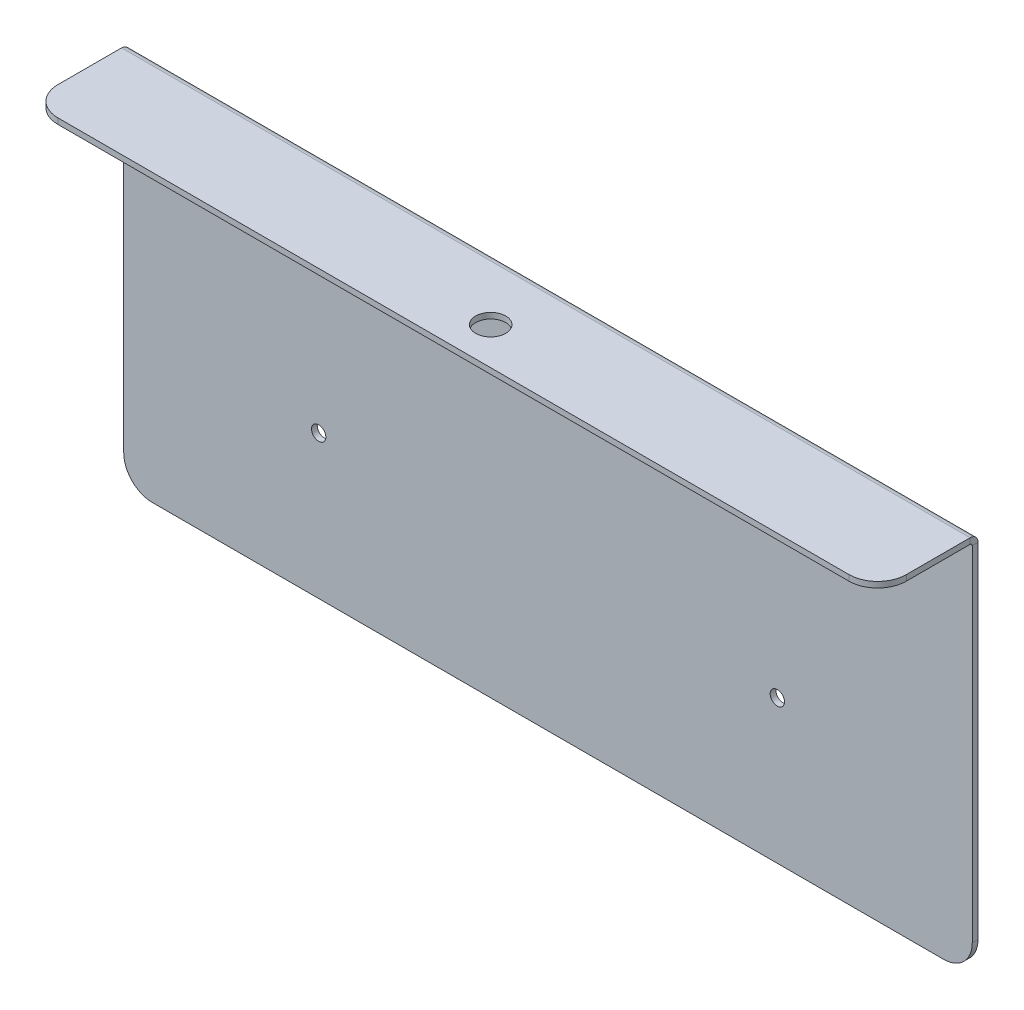
ISO-10303-21;
HEADER;
FILE_DESCRIPTION(('STEP AP214'),'2;1');
FILE_NAME('part.step','',(''),(''),'','','');
FILE_SCHEMA(('AUTOMOTIVE_DESIGN { 1 0 10303 214 1 1 1 1 }'));
ENDSEC;
DATA;
#1=APPLICATION_CONTEXT('core data for automotive mechanical design processes');
#2=APPLICATION_PROTOCOL_DEFINITION('international standard','automotive_design',2000,#1);
#3=PRODUCT_CONTEXT('',#1,'mechanical');
#4=PRODUCT('Part','Part','',(#3));
#5=PRODUCT_RELATED_PRODUCT_CATEGORY('part','',(#4));
#6=PRODUCT_DEFINITION_FORMATION('','',#4);
#7=PRODUCT_DEFINITION_CONTEXT('part definition',#1,'design');
#8=PRODUCT_DEFINITION('design','',#6,#7);
#9=PRODUCT_DEFINITION_SHAPE('','',#8);
#10=(LENGTH_UNIT() NAMED_UNIT(*) SI_UNIT(.MILLI.,.METRE.));
#11=(NAMED_UNIT(*) PLANE_ANGLE_UNIT() SI_UNIT($,.RADIAN.));
#12=(NAMED_UNIT(*) SI_UNIT($,.STERADIAN.) SOLID_ANGLE_UNIT());
#13=UNCERTAINTY_MEASURE_WITH_UNIT(LENGTH_MEASURE(1.E-05),#10,'distance_accuracy_value','');
#14=(GEOMETRIC_REPRESENTATION_CONTEXT(3) GLOBAL_UNCERTAINTY_ASSIGNED_CONTEXT((#13)) GLOBAL_UNIT_ASSIGNED_CONTEXT((#10,
#11,#12)) REPRESENTATION_CONTEXT('',''));
#15=CARTESIAN_POINT('',(0.,0.,0.));
#16=DIRECTION('',(0.,0.,1.));
#17=DIRECTION('',(1.,0.,0.));
#18=AXIS2_PLACEMENT_3D('',#15,#16,#17);
#19=CARTESIAN_POINT('',(-138.,67.7366000000001,23.));
#20=DIRECTION('',(0.,-1.,0.));
#21=DIRECTION('',(0.,0.,-1.));
#22=AXIS2_PLACEMENT_3D('',#19,#20,#21);
#23=CYLINDRICAL_SURFACE('',#22,10.);
#24=DIRECTION('',(0.,1.,0.));
#25=VECTOR('',#24,1.);
#26=CARTESIAN_POINT('',(-148.,67.7366000000001,23.));
#27=LINE('',#26,#25);
#28=CARTESIAN_POINT('',(-148.,65.7366000000001,23.));
#29=VERTEX_POINT('',#28);
#30=CARTESIAN_POINT('',(-148.,67.7366000000001,23.));
#31=VERTEX_POINT('',#30);
#32=EDGE_CURVE('E11',#29,#31,#27,.T.);
#33=ORIENTED_EDGE('',*,*,#32,.F.);
#34=CARTESIAN_POINT('',(-138.,65.7366000000001,23.));
#35=DIRECTION('',(0.,-1.,0.));
#36=DIRECTION('',(0.,0.,-1.));
#37=AXIS2_PLACEMENT_3D('',#34,#35,#36);
#38=CIRCLE('',#37,10.);
#39=CARTESIAN_POINT('',(-138.,65.7366000000001,33.));
#40=VERTEX_POINT('',#39);
#41=EDGE_CURVE('E101',#29,#40,#38,.F.);
#42=ORIENTED_EDGE('',*,*,#41,.T.);
#43=DIRECTION('',(0.,1.,0.));
#44=VECTOR('',#43,1.);
#45=CARTESIAN_POINT('',(-138.,67.7366000000001,33.));
#46=LINE('',#45,#44);
#47=CARTESIAN_POINT('',(-138.,67.7366000000001,33.));
#48=VERTEX_POINT('',#47);
#49=EDGE_CURVE('E51',#40,#48,#46,.T.);
#50=ORIENTED_EDGE('',*,*,#49,.T.);
#51=CARTESIAN_POINT('',(-138.,67.7366000000001,23.));
#52=DIRECTION('',(0.,-1.,0.));
#53=DIRECTION('',(0.,0.,-1.));
#54=AXIS2_PLACEMENT_3D('',#51,#52,#53);
#55=CIRCLE('',#54,10.);
#56=EDGE_CURVE('E104',#31,#48,#55,.F.);
#57=ORIENTED_EDGE('',*,*,#56,.F.);
#58=EDGE_LOOP('',(#33,#42,#50,#57));
#59=FACE_BOUND('',#58,.T.);
#60=ADVANCED_FACE('F41',(#59),#23,.T.);
#61=CARTESIAN_POINT('',(0.,67.7366000000001,33.));
#62=DIRECTION('',(0.,0.,-1.));
#63=DIRECTION('',(1.,0.,0.));
#64=AXIS2_PLACEMENT_3D('',#61,#62,#63);
#65=PLANE('',#64);
#66=ORIENTED_EDGE('',*,*,#49,.F.);
#67=DIRECTION('',(1.,0.,0.));
#68=VECTOR('',#67,1.);
#69=CARTESIAN_POINT('',(0.,65.7366000000001,33.));
#70=LINE('',#69,#68);
#71=CARTESIAN_POINT('',(138.,65.7366000000001,33.));
#72=VERTEX_POINT('',#71);
#73=EDGE_CURVE('E117',#40,#72,#70,.T.);
#74=ORIENTED_EDGE('',*,*,#73,.T.);
#75=DIRECTION('',(0.,1.,0.));
#76=VECTOR('',#75,1.);
#77=CARTESIAN_POINT('',(138.,67.7366000000001,33.));
#78=LINE('',#77,#76);
#79=CARTESIAN_POINT('',(138.,67.7366000000001,33.));
#80=VERTEX_POINT('',#79);
#81=EDGE_CURVE('E158',#72,#80,#78,.T.);
#82=ORIENTED_EDGE('',*,*,#81,.T.);
#83=DIRECTION('',(1.,0.,0.));
#84=VECTOR('',#83,1.);
#85=CARTESIAN_POINT('',(0.,67.7366000000001,33.));
#86=LINE('',#85,#84);
#87=EDGE_CURVE('E170',#48,#80,#86,.T.);
#88=ORIENTED_EDGE('',*,*,#87,.F.);
#89=EDGE_LOOP('',(#66,#74,#82,#88));
#90=FACE_BOUND('',#89,.T.);
#91=ADVANCED_FACE('F175',(#90),#65,.F.);
#92=CARTESIAN_POINT('',(138.,67.7366000000001,23.));
#93=DIRECTION('',(0.,-1.,0.));
#94=DIRECTION('',(0.,0.,-1.));
#95=AXIS2_PLACEMENT_3D('',#92,#93,#94);
#96=CYLINDRICAL_SURFACE('',#95,10.);
#97=ORIENTED_EDGE('',*,*,#81,.F.);
#98=CARTESIAN_POINT('',(138.,65.7366000000001,23.));
#99=DIRECTION('',(0.,-1.,0.));
#100=DIRECTION('',(0.,0.,-1.));
#101=AXIS2_PLACEMENT_3D('',#98,#99,#100);
#102=CIRCLE('',#101,10.);
#103=CARTESIAN_POINT('',(148.,65.7366000000001,23.));
#104=VERTEX_POINT('',#103);
#105=EDGE_CURVE('E220',#72,#104,#102,.F.);
#106=ORIENTED_EDGE('',*,*,#105,.T.);
#107=DIRECTION('',(0.,1.,0.));
#108=VECTOR('',#107,1.);
#109=CARTESIAN_POINT('',(148.,67.7366000000001,23.));
#110=LINE('',#109,#108);
#111=CARTESIAN_POINT('',(148.,67.7366000000001,23.));
#112=VERTEX_POINT('',#111);
#113=EDGE_CURVE('E155',#104,#112,#110,.T.);
#114=ORIENTED_EDGE('',*,*,#113,.T.);
#115=CARTESIAN_POINT('',(138.,67.7366000000001,23.));
#116=DIRECTION('',(0.,-1.,0.));
#117=DIRECTION('',(0.,0.,-1.));
#118=AXIS2_PLACEMENT_3D('',#115,#116,#117);
#119=CIRCLE('',#118,10.);
#120=EDGE_CURVE('E176',#80,#112,#119,.F.);
#121=ORIENTED_EDGE('',*,*,#120,.F.);
#122=EDGE_LOOP('',(#97,#106,#114,#121));
#123=FACE_BOUND('',#122,.T.);
#124=ADVANCED_FACE('F223',(#123),#96,.T.);
#125=CARTESIAN_POINT('',(148.,67.7366,-2.25663255406884E-13));
#126=DIRECTION('',(-1.,0.,0.));
#127=DIRECTION('',(0.,0.,-1.));
#128=AXIS2_PLACEMENT_3D('',#125,#126,#127);
#129=PLANE('',#128);
#130=ORIENTED_EDGE('',*,*,#113,.F.);
#131=DIRECTION('',(0.,0.,-1.));
#132=VECTOR('',#131,1.);
#133=CARTESIAN_POINT('',(148.,65.7366,-2.18934631015216E-13));
#134=LINE('',#133,#132);
#135=CARTESIAN_POINT('',(148.,65.7366,0.736600000000008));
#136=VERTEX_POINT('',#135);
#137=EDGE_CURVE('E200',#104,#136,#134,.T.);
#138=ORIENTED_EDGE('',*,*,#137,.T.);
#139=DIRECTION('',(0.,1.,0.));
#140=VECTOR('',#139,1.);
#141=CARTESIAN_POINT('',(148.,67.7366,0.736600000000001));
#142=LINE('',#141,#140);
#143=CARTESIAN_POINT('',(148.,67.7366,0.736600000000001));
#144=VERTEX_POINT('',#143);
#145=EDGE_CURVE('E153',#136,#144,#142,.T.);
#146=ORIENTED_EDGE('',*,*,#145,.T.);
#147=DIRECTION('',(0.,0.,-1.));
#148=VECTOR('',#147,1.);
#149=CARTESIAN_POINT('',(148.,67.7366,-2.25663255406884E-13));
#150=LINE('',#149,#148);
#151=EDGE_CURVE('E178',#112,#144,#150,.T.);
#152=ORIENTED_EDGE('',*,*,#151,.F.);
#153=EDGE_LOOP('',(#130,#138,#146,#152));
#154=FACE_BOUND('',#153,.T.);
#155=ADVANCED_FACE('F226',(#154),#129,.F.);
#156=CARTESIAN_POINT('',(148.,65.,0.73660000000001));
#157=DIRECTION('',(1.,0.,0.));
#158=DIRECTION('',(0.,0.,-1.));
#159=AXIS2_PLACEMENT_3D('',#156,#157,#158);
#160=PLANE('',#159);
#161=ORIENTED_EDGE('',*,*,#145,.F.);
#162=CARTESIAN_POINT('',(148.,65.,0.73660000000001));
#163=DIRECTION('',(-1.,0.,0.));
#164=DIRECTION('',(0.,0.,1.));
#165=AXIS2_PLACEMENT_3D('',#162,#163,#164);
#166=CIRCLE('',#165,0.736600000000004);
#167=CARTESIAN_POINT('',(148.,65.,0.));
#168=VERTEX_POINT('',#167);
#169=EDGE_CURVE('E203',#168,#136,#166,.F.);
#170=ORIENTED_EDGE('',*,*,#169,.F.);
#171=DIRECTION('',(0.,0.,-1.));
#172=VECTOR('',#171,1.);
#173=CARTESIAN_POINT('',(148.,65.,-2.));
#174=LINE('',#173,#172);
#175=CARTESIAN_POINT('',(148.,65.,-2.));
#176=VERTEX_POINT('',#175);
#177=EDGE_CURVE('E150',#168,#176,#174,.T.);
#178=ORIENTED_EDGE('',*,*,#177,.T.);
#179=CARTESIAN_POINT('',(148.,65.,0.73660000000001));
#180=DIRECTION('',(-1.,0.,0.));
#181=DIRECTION('',(0.,0.,1.));
#182=AXIS2_PLACEMENT_3D('',#179,#180,#181);
#183=CIRCLE('',#182,2.7366);
#184=EDGE_CURVE('E189',#176,#144,#183,.F.);
#185=ORIENTED_EDGE('',*,*,#184,.T.);
#186=EDGE_LOOP('',(#161,#170,#178,#185));
#187=FACE_BOUND('',#186,.T.);
#188=ADVANCED_FACE('F233',(#187),#160,.T.);
#189=CARTESIAN_POINT('',(148.,-65.,-2.));
#190=DIRECTION('',(-1.,0.,0.));
#191=DIRECTION('',(0.,1.,0.));
#192=AXIS2_PLACEMENT_3D('',#189,#190,#191);
#193=PLANE('',#192);
#194=ORIENTED_EDGE('',*,*,#177,.F.);
#195=DIRECTION('',(0.,1.,0.));
#196=VECTOR('',#195,1.);
#197=CARTESIAN_POINT('',(148.,0.,0.));
#198=LINE('',#197,#196);
#199=CARTESIAN_POINT('',(148.,-55.,0.));
#200=VERTEX_POINT('',#199);
#201=EDGE_CURVE('E195',#200,#168,#198,.T.);
#202=ORIENTED_EDGE('',*,*,#201,.F.);
#203=DIRECTION('',(0.,0.,-1.));
#204=VECTOR('',#203,1.);
#205=CARTESIAN_POINT('',(148.,-55.,-2.));
#206=LINE('',#205,#204);
#207=CARTESIAN_POINT('',(148.,-55.,-2.));
#208=VERTEX_POINT('',#207);
#209=EDGE_CURVE('E147',#200,#208,#206,.T.);
#210=ORIENTED_EDGE('',*,*,#209,.T.);
#211=DIRECTION('',(0.,1.,0.));
#212=VECTOR('',#211,1.);
#213=CARTESIAN_POINT('',(148.,-65.,-2.));
#214=LINE('',#213,#212);
#215=EDGE_CURVE('E283',#208,#176,#214,.T.);
#216=ORIENTED_EDGE('',*,*,#215,.T.);
#217=EDGE_LOOP('',(#194,#202,#210,#216));
#218=FACE_BOUND('',#217,.T.);
#219=ADVANCED_FACE('F340',(#218),#193,.F.);
#220=CARTESIAN_POINT('',(138.,-55.,-2.));
#221=DIRECTION('',(0.,0.,-1.));
#222=DIRECTION('',(-1.,0.,0.));
#223=AXIS2_PLACEMENT_3D('',#220,#221,#222);
#224=CYLINDRICAL_SURFACE('',#223,10.);
#225=ORIENTED_EDGE('',*,*,#209,.F.);
#226=CARTESIAN_POINT('',(138.,-55.,0.));
#227=DIRECTION('',(0.,0.,-1.));
#228=DIRECTION('',(-1.,0.,0.));
#229=AXIS2_PLACEMENT_3D('',#226,#227,#228);
#230=CIRCLE('',#229,10.);
#231=CARTESIAN_POINT('',(138.,-65.,0.));
#232=VERTEX_POINT('',#231);
#233=EDGE_CURVE('E124',#200,#232,#230,.T.);
#234=ORIENTED_EDGE('',*,*,#233,.T.);
#235=DIRECTION('',(0.,0.,-1.));
#236=VECTOR('',#235,1.);
#237=CARTESIAN_POINT('',(138.,-65.,-2.));
#238=LINE('',#237,#236);
#239=CARTESIAN_POINT('',(138.,-65.,-2.));
#240=VERTEX_POINT('',#239);
#241=EDGE_CURVE('E144',#232,#240,#238,.T.);
#242=ORIENTED_EDGE('',*,*,#241,.T.);
#243=CARTESIAN_POINT('',(138.,-55.,-2.));
#244=DIRECTION('',(0.,0.,-1.));
#245=DIRECTION('',(-1.,0.,0.));
#246=AXIS2_PLACEMENT_3D('',#243,#244,#245);
#247=CIRCLE('',#246,10.);
#248=EDGE_CURVE('E272',#208,#240,#247,.T.);
#249=ORIENTED_EDGE('',*,*,#248,.F.);
#250=EDGE_LOOP('',(#225,#234,#242,#249));
#251=FACE_BOUND('',#250,.T.);
#252=ADVANCED_FACE('F338',(#251),#224,.T.);
#253=CARTESIAN_POINT('',(-148.,-65.,-2.));
#254=DIRECTION('',(0.,1.,0.));
#255=DIRECTION('',(1.,0.,0.));
#256=AXIS2_PLACEMENT_3D('',#253,#254,#255);
#257=PLANE('',#256);
#258=ORIENTED_EDGE('',*,*,#241,.F.);
#259=DIRECTION('',(-1.,0.,0.));
#260=VECTOR('',#259,1.);
#261=CARTESIAN_POINT('',(0.,-65.,0.));
#262=LINE('',#261,#260);
#263=CARTESIAN_POINT('',(-138.,-65.,0.));
#264=VERTEX_POINT('',#263);
#265=EDGE_CURVE('E134',#264,#232,#262,.F.);
#266=ORIENTED_EDGE('',*,*,#265,.F.);
#267=DIRECTION('',(0.,0.,-1.));
#268=VECTOR('',#267,1.);
#269=CARTESIAN_POINT('',(-138.,-65.,-2.));
#270=LINE('',#269,#268);
#271=CARTESIAN_POINT('',(-138.,-65.,-2.));
#272=VERTEX_POINT('',#271);
#273=EDGE_CURVE('E141',#264,#272,#270,.T.);
#274=ORIENTED_EDGE('',*,*,#273,.T.);
#275=DIRECTION('',(1.,0.,0.));
#276=VECTOR('',#275,1.);
#277=CARTESIAN_POINT('',(-148.,-65.,-2.));
#278=LINE('',#277,#276);
#279=EDGE_CURVE('E259',#272,#240,#278,.T.);
#280=ORIENTED_EDGE('',*,*,#279,.T.);
#281=EDGE_LOOP('',(#258,#266,#274,#280));
#282=FACE_BOUND('',#281,.T.);
#283=ADVANCED_FACE('F258',(#282),#257,.F.);
#284=CARTESIAN_POINT('',(-138.,-55.,-2.));
#285=DIRECTION('',(0.,0.,-1.));
#286=DIRECTION('',(-1.,0.,0.));
#287=AXIS2_PLACEMENT_3D('',#284,#285,#286);
#288=CYLINDRICAL_SURFACE('',#287,10.);
#289=ORIENTED_EDGE('',*,*,#273,.F.);
#290=CARTESIAN_POINT('',(-138.,-55.,0.));
#291=DIRECTION('',(0.,0.,-1.));
#292=DIRECTION('',(-1.,0.,0.));
#293=AXIS2_PLACEMENT_3D('',#290,#291,#292);
#294=CIRCLE('',#293,10.);
#295=CARTESIAN_POINT('',(-148.,-55.,0.));
#296=VERTEX_POINT('',#295);
#297=EDGE_CURVE('E206',#264,#296,#294,.T.);
#298=ORIENTED_EDGE('',*,*,#297,.T.);
#299=DIRECTION('',(0.,0.,-1.));
#300=VECTOR('',#299,1.);
#301=CARTESIAN_POINT('',(-148.,-55.,-2.));
#302=LINE('',#301,#300);
#303=CARTESIAN_POINT('',(-148.,-55.,-2.));
#304=VERTEX_POINT('',#303);
#305=EDGE_CURVE('E138',#296,#304,#302,.T.);
#306=ORIENTED_EDGE('',*,*,#305,.T.);
#307=CARTESIAN_POINT('',(-138.,-55.,-2.));
#308=DIRECTION('',(0.,0.,-1.));
#309=DIRECTION('',(-1.,0.,0.));
#310=AXIS2_PLACEMENT_3D('',#307,#308,#309);
#311=CIRCLE('',#310,10.);
#312=EDGE_CURVE('E268',#272,#304,#311,.T.);
#313=ORIENTED_EDGE('',*,*,#312,.F.);
#314=EDGE_LOOP('',(#289,#298,#306,#313));
#315=FACE_BOUND('',#314,.T.);
#316=ADVANCED_FACE('F275',(#315),#288,.T.);
#317=CARTESIAN_POINT('',(-148.,-65.,-2.));
#318=DIRECTION('',(1.,0.,0.));
#319=DIRECTION('',(0.,-1.,0.));
#320=AXIS2_PLACEMENT_3D('',#317,#318,#319);
#321=PLANE('',#320);
#322=ORIENTED_EDGE('',*,*,#305,.F.);
#323=DIRECTION('',(0.,1.,0.));
#324=VECTOR('',#323,1.);
#325=CARTESIAN_POINT('',(-148.,0.,0.));
#326=LINE('',#325,#324);
#327=CARTESIAN_POINT('',(-148.,65.,0.));
#328=VERTEX_POINT('',#327);
#329=EDGE_CURVE('E196',#328,#296,#326,.F.);
#330=ORIENTED_EDGE('',*,*,#329,.F.);
#331=DIRECTION('',(0.,0.,-1.));
#332=VECTOR('',#331,1.);
#333=CARTESIAN_POINT('',(-148.,65.,-2.00000000000002));
#334=LINE('',#333,#332);
#335=CARTESIAN_POINT('',(-148.,65.,-2.00000000000002));
#336=VERTEX_POINT('',#335);
#337=EDGE_CURVE('E135',#328,#336,#334,.T.);
#338=ORIENTED_EDGE('',*,*,#337,.T.);
#339=DIRECTION('',(0.,-1.,0.));
#340=VECTOR('',#339,1.);
#341=CARTESIAN_POINT('',(-148.,-65.,-2.));
#342=LINE('',#341,#340);
#343=EDGE_CURVE('E276',#336,#304,#342,.T.);
#344=ORIENTED_EDGE('',*,*,#343,.T.);
#345=EDGE_LOOP('',(#322,#330,#338,#344));
#346=FACE_BOUND('',#345,.T.);
#347=ADVANCED_FACE('F322',(#346),#321,.F.);
#348=CARTESIAN_POINT('',(-148.,65.,0.736599999999988));
#349=DIRECTION('',(1.,0.,0.));
#350=DIRECTION('',(0.,0.,-1.));
#351=AXIS2_PLACEMENT_3D('',#348,#349,#350);
#352=PLANE('',#351);
#353=ORIENTED_EDGE('',*,*,#337,.F.);
#354=CARTESIAN_POINT('',(-148.,65.,0.736599999999988));
#355=DIRECTION('',(-1.,0.,0.));
#356=DIRECTION('',(0.,0.,1.));
#357=AXIS2_PLACEMENT_3D('',#354,#355,#356);
#358=CIRCLE('',#357,0.736600000000004);
#359=CARTESIAN_POINT('',(-148.,65.7366,0.736599999999988));
#360=VERTEX_POINT('',#359);
#361=EDGE_CURVE('E199',#360,#328,#358,.T.);
#362=ORIENTED_EDGE('',*,*,#361,.F.);
#363=DIRECTION('',(0.,1.,0.));
#364=VECTOR('',#363,1.);
#365=CARTESIAN_POINT('',(-148.,67.7366,0.736599999999983));
#366=LINE('',#365,#364);
#367=CARTESIAN_POINT('',(-148.,67.7366,0.736599999999983));
#368=VERTEX_POINT('',#367);
#369=EDGE_CURVE('E45',#360,#368,#366,.T.);
#370=ORIENTED_EDGE('',*,*,#369,.T.);
#371=CARTESIAN_POINT('',(-148.,65.,0.736599999999988));
#372=DIRECTION('',(-1.,0.,0.));
#373=DIRECTION('',(0.,0.,1.));
#374=AXIS2_PLACEMENT_3D('',#371,#372,#373);
#375=CIRCLE('',#374,2.7366);
#376=EDGE_CURVE('E187',#368,#336,#375,.T.);
#377=ORIENTED_EDGE('',*,*,#376,.T.);
#378=EDGE_LOOP('',(#353,#362,#370,#377));
#379=FACE_BOUND('',#378,.T.);
#380=ADVANCED_FACE('F315',(#379),#352,.F.);
#381=CARTESIAN_POINT('',(-80.,-15.,-2.));
#382=DIRECTION('',(0.,0.,-1.));
#383=DIRECTION('',(-1.,0.,0.));
#384=AXIS2_PLACEMENT_3D('',#381,#382,#383);
#385=CYLINDRICAL_SURFACE('',#384,2.5);
#386=CARTESIAN_POINT('',(-80.,-15.,-2.));
#387=DIRECTION('',(0.,0.,-1.));
#388=DIRECTION('',(-1.,0.,0.));
#389=AXIS2_PLACEMENT_3D('',#386,#387,#388);
#390=CIRCLE('',#389,2.5);
#391=CARTESIAN_POINT('',(-82.5,-15.,-2.));
#392=VERTEX_POINT('',#391);
#393=EDGE_CURVE('E217',#392,#392,#390,.T.);
#394=ORIENTED_EDGE('',*,*,#393,.T.);
#395=EDGE_LOOP('',(#394));
#396=FACE_BOUND('',#395,.T.);
#397=CARTESIAN_POINT('',(-80.,-15.,0.));
#398=DIRECTION('',(0.,0.,-1.));
#399=DIRECTION('',(-1.,0.,0.));
#400=AXIS2_PLACEMENT_3D('',#397,#398,#399);
#401=CIRCLE('',#400,2.5);
#402=CARTESIAN_POINT('',(-82.5,-15.,0.));
#403=VERTEX_POINT('',#402);
#404=EDGE_CURVE('E128',#403,#403,#401,.T.);
#405=ORIENTED_EDGE('',*,*,#404,.F.);
#406=EDGE_LOOP('',(#405));
#407=FACE_BOUND('',#406,.T.);
#408=ADVANCED_FACE('F313',(#396,#407),#385,.F.);
#409=CARTESIAN_POINT('',(80.,-15.,-2.));
#410=DIRECTION('',(0.,0.,-1.));
#411=DIRECTION('',(-1.,0.,0.));
#412=AXIS2_PLACEMENT_3D('',#409,#410,#411);
#413=CYLINDRICAL_SURFACE('',#412,2.5);
#414=CARTESIAN_POINT('',(80.,-15.,-2.));
#415=DIRECTION('',(0.,0.,-1.));
#416=DIRECTION('',(-1.,0.,0.));
#417=AXIS2_PLACEMENT_3D('',#414,#415,#416);
#418=CIRCLE('',#417,2.5);
#419=CARTESIAN_POINT('',(77.5,-15.,-2.));
#420=VERTEX_POINT('',#419);
#421=EDGE_CURVE('E273',#420,#420,#418,.T.);
#422=ORIENTED_EDGE('',*,*,#421,.T.);
#423=EDGE_LOOP('',(#422));
#424=FACE_BOUND('',#423,.T.);
#425=CARTESIAN_POINT('',(80.,-15.,0.));
#426=DIRECTION('',(0.,0.,-1.));
#427=DIRECTION('',(-1.,0.,0.));
#428=AXIS2_PLACEMENT_3D('',#425,#426,#427);
#429=CIRCLE('',#428,2.5);
#430=CARTESIAN_POINT('',(77.5,-15.,0.));
#431=VERTEX_POINT('',#430);
#432=EDGE_CURVE('E131',#431,#431,#429,.T.);
#433=ORIENTED_EDGE('',*,*,#432,.F.);
#434=EDGE_LOOP('',(#433));
#435=FACE_BOUND('',#434,.T.);
#436=ADVANCED_FACE('F43',(#424,#435),#413,.F.);
#437=CARTESIAN_POINT('',(0.,67.7366000000001,19.9999999999998));
#438=DIRECTION('',(0.,-1.,0.));
#439=DIRECTION('',(0.,0.,-1.));
#440=AXIS2_PLACEMENT_3D('',#437,#438,#439);
#441=CYLINDRICAL_SURFACE('',#440,5.24999999999998);
#442=CARTESIAN_POINT('',(0.,67.7366000000001,19.9999999999998));
#443=DIRECTION('',(0.,1.,0.));
#444=DIRECTION('',(0.,0.,1.));
#445=AXIS2_PLACEMENT_3D('',#442,#443,#444);
#446=CIRCLE('',#445,5.24999999999998);
#447=CARTESIAN_POINT('',(0.,67.7366000000001,25.2499999999998));
#448=VERTEX_POINT('',#447);
#449=EDGE_CURVE('E286',#448,#448,#446,.T.);
#450=ORIENTED_EDGE('',*,*,#449,.T.);
#451=EDGE_LOOP('',(#450));
#452=FACE_BOUND('',#451,.T.);
#453=CARTESIAN_POINT('',(0.,65.7366000000001,19.9999999999998));
#454=DIRECTION('',(0.,1.,0.));
#455=DIRECTION('',(0.,0.,1.));
#456=AXIS2_PLACEMENT_3D('',#453,#454,#455);
#457=CIRCLE('',#456,5.24999999999998);
#458=CARTESIAN_POINT('',(0.,65.7366000000001,25.2499999999998));
#459=VERTEX_POINT('',#458);
#460=EDGE_CURVE('E121',#459,#459,#457,.T.);
#461=ORIENTED_EDGE('',*,*,#460,.F.);
#462=EDGE_LOOP('',(#461));
#463=FACE_BOUND('',#462,.T.);
#464=ADVANCED_FACE('F290',(#452,#463),#441,.F.);
#465=CARTESIAN_POINT('',(-148.,67.7366,-2.25663255406884E-13));
#466=DIRECTION('',(1.,0.,0.));
#467=DIRECTION('',(0.,0.,1.));
#468=AXIS2_PLACEMENT_3D('',#465,#466,#467);
#469=PLANE('',#468);
#470=DIRECTION('',(0.,0.,-1.));
#471=VECTOR('',#470,1.);
#472=CARTESIAN_POINT('',(-148.,65.7366,-2.18934631015216E-13));
#473=LINE('',#472,#471);
#474=EDGE_CURVE('E114',#360,#29,#473,.F.);
#475=ORIENTED_EDGE('',*,*,#474,.T.);
#476=ORIENTED_EDGE('',*,*,#32,.T.);
#477=DIRECTION('',(0.,0.,1.));
#478=VECTOR('',#477,1.);
#479=CARTESIAN_POINT('',(-148.,67.7366,-2.25663255406884E-13));
#480=LINE('',#479,#478);
#481=EDGE_CURVE('E173',#368,#31,#480,.T.);
#482=ORIENTED_EDGE('',*,*,#481,.F.);
#483=ORIENTED_EDGE('',*,*,#369,.F.);
#484=EDGE_LOOP('',(#475,#476,#482,#483));
#485=FACE_BOUND('',#484,.T.);
#486=ADVANCED_FACE('F119',(#485),#469,.F.);
#487=CARTESIAN_POINT('',(-148.,65.,0.736599999999988));
#488=DIRECTION('',(-1.,0.,0.));
#489=DIRECTION('',(0.,1.,0.));
#490=AXIS2_PLACEMENT_3D('',#487,#488,#489);
#491=CYLINDRICAL_SURFACE('',#490,2.7366);
#492=DIRECTION('',(-1.,0.,0.));
#493=VECTOR('',#492,1.);
#494=CARTESIAN_POINT('',(-148.,65.,-2.));
#495=LINE('',#494,#493);
#496=EDGE_CURVE('E278',#176,#336,#495,.T.);
#497=ORIENTED_EDGE('',*,*,#496,.T.);
#498=ORIENTED_EDGE('',*,*,#376,.F.);
#499=DIRECTION('',(-1.,0.,0.));
#500=VECTOR('',#499,1.);
#501=CARTESIAN_POINT('',(148.,67.7366,0.736599999999997));
#502=LINE('',#501,#500);
#503=EDGE_CURVE('E184',#368,#144,#502,.F.);
#504=ORIENTED_EDGE('',*,*,#503,.T.);
#505=ORIENTED_EDGE('',*,*,#184,.F.);
#506=EDGE_LOOP('',(#497,#498,#504,#505));
#507=FACE_BOUND('',#506,.T.);
#508=ADVANCED_FACE('F240',(#507),#491,.T.);
#509=CARTESIAN_POINT('',(0.,67.7366,-2.25663255406884E-13));
#510=DIRECTION('',(0.,-1.,0.));
#511=DIRECTION('',(0.,0.,-1.));
#512=AXIS2_PLACEMENT_3D('',#509,#510,#511);
#513=PLANE('',#512);
#514=ORIENTED_EDGE('',*,*,#449,.F.);
#515=EDGE_LOOP('',(#514));
#516=FACE_BOUND('',#515,.T.);
#517=ORIENTED_EDGE('',*,*,#481,.T.);
#518=ORIENTED_EDGE('',*,*,#56,.T.);
#519=ORIENTED_EDGE('',*,*,#87,.T.);
#520=ORIENTED_EDGE('',*,*,#120,.T.);
#521=ORIENTED_EDGE('',*,*,#151,.T.);
#522=ORIENTED_EDGE('',*,*,#503,.F.);
#523=EDGE_LOOP('',(#517,#518,#519,#520,#521,#522));
#524=FACE_BOUND('',#523,.T.);
#525=ADVANCED_FACE('F168',(#516,#524),#513,.F.);
#526=CARTESIAN_POINT('',(0.,0.,-2.));
#527=DIRECTION('',(0.,0.,-1.));
#528=DIRECTION('',(-1.,0.,0.));
#529=AXIS2_PLACEMENT_3D('',#526,#527,#528);
#530=PLANE('',#529);
#531=ORIENTED_EDGE('',*,*,#393,.F.);
#532=EDGE_LOOP('',(#531));
#533=FACE_BOUND('',#532,.T.);
#534=ORIENTED_EDGE('',*,*,#421,.F.);
#535=EDGE_LOOP('',(#534));
#536=FACE_BOUND('',#535,.T.);
#537=ORIENTED_EDGE('',*,*,#279,.F.);
#538=ORIENTED_EDGE('',*,*,#312,.T.);
#539=ORIENTED_EDGE('',*,*,#343,.F.);
#540=ORIENTED_EDGE('',*,*,#496,.F.);
#541=ORIENTED_EDGE('',*,*,#215,.F.);
#542=ORIENTED_EDGE('',*,*,#248,.T.);
#543=EDGE_LOOP('',(#537,#538,#539,#540,#541,#542));
#544=FACE_BOUND('',#543,.T.);
#545=ADVANCED_FACE('F266',(#533,#536,#544),#530,.T.);
#546=CARTESIAN_POINT('',(-148.,65.,0.736599999999988));
#547=DIRECTION('',(-1.,0.,0.));
#548=DIRECTION('',(0.,1.,0.));
#549=AXIS2_PLACEMENT_3D('',#546,#547,#548);
#550=CYLINDRICAL_SURFACE('',#549,0.736600000000004);
#551=DIRECTION('',(-1.,0.,0.));
#552=VECTOR('',#551,1.);
#553=CARTESIAN_POINT('',(-148.,65.,0.));
#554=LINE('',#553,#552);
#555=EDGE_CURVE('E192',#168,#328,#554,.T.);
#556=ORIENTED_EDGE('',*,*,#555,.F.);
#557=ORIENTED_EDGE('',*,*,#169,.T.);
#558=DIRECTION('',(-1.,0.,0.));
#559=VECTOR('',#558,1.);
#560=CARTESIAN_POINT('',(-148.,65.7366,0.736599999999986));
#561=LINE('',#560,#559);
#562=EDGE_CURVE('E197',#360,#136,#561,.F.);
#563=ORIENTED_EDGE('',*,*,#562,.F.);
#564=ORIENTED_EDGE('',*,*,#361,.T.);
#565=EDGE_LOOP('',(#556,#557,#563,#564));
#566=FACE_BOUND('',#565,.T.);
#567=ADVANCED_FACE('F231',(#566),#550,.F.);
#568=CARTESIAN_POINT('',(0.,65.7366,-2.18934631015216E-13));
#569=DIRECTION('',(0.,-1.,0.));
#570=DIRECTION('',(0.,0.,-1.));
#571=AXIS2_PLACEMENT_3D('',#568,#569,#570);
#572=PLANE('',#571);
#573=ORIENTED_EDGE('',*,*,#460,.T.);
#574=EDGE_LOOP('',(#573));
#575=FACE_BOUND('',#574,.T.);
#576=ORIENTED_EDGE('',*,*,#474,.F.);
#577=ORIENTED_EDGE('',*,*,#562,.T.);
#578=ORIENTED_EDGE('',*,*,#137,.F.);
#579=ORIENTED_EDGE('',*,*,#105,.F.);
#580=ORIENTED_EDGE('',*,*,#73,.F.);
#581=ORIENTED_EDGE('',*,*,#41,.F.);
#582=EDGE_LOOP('',(#576,#577,#578,#579,#580,#581));
#583=FACE_BOUND('',#582,.T.);
#584=ADVANCED_FACE('F112',(#575,#583),#572,.T.);
#585=CARTESIAN_POINT('',(0.,0.,0.));
#586=DIRECTION('',(0.,0.,-1.));
#587=DIRECTION('',(-1.,0.,0.));
#588=AXIS2_PLACEMENT_3D('',#585,#586,#587);
#589=PLANE('',#588);
#590=ORIENTED_EDGE('',*,*,#404,.T.);
#591=EDGE_LOOP('',(#590));
#592=FACE_BOUND('',#591,.T.);
#593=ORIENTED_EDGE('',*,*,#432,.T.);
#594=EDGE_LOOP('',(#593));
#595=FACE_BOUND('',#594,.T.);
#596=ORIENTED_EDGE('',*,*,#265,.T.);
#597=ORIENTED_EDGE('',*,*,#233,.F.);
#598=ORIENTED_EDGE('',*,*,#201,.T.);
#599=ORIENTED_EDGE('',*,*,#555,.T.);
#600=ORIENTED_EDGE('',*,*,#329,.T.);
#601=ORIENTED_EDGE('',*,*,#297,.F.);
#602=EDGE_LOOP('',(#596,#597,#598,#599,#600,#601));
#603=FACE_BOUND('',#602,.T.);
#604=ADVANCED_FACE('F329',(#592,#595,#603),#589,.F.);
#605=CLOSED_SHELL('',(#60,#91,#124,#155,#188,#219,#252,#283,#316,#347,#380,#408,#436,#464,#486,
#508,#525,#545,#567,#584,#604));
#606=MANIFOLD_SOLID_BREP('B2',#605);
#607=ADVANCED_BREP_SHAPE_REPRESENTATION('',(#18,#606),#14);
#608=SHAPE_DEFINITION_REPRESENTATION(#9,#607);
ENDSEC;
END-ISO-10303-21;
